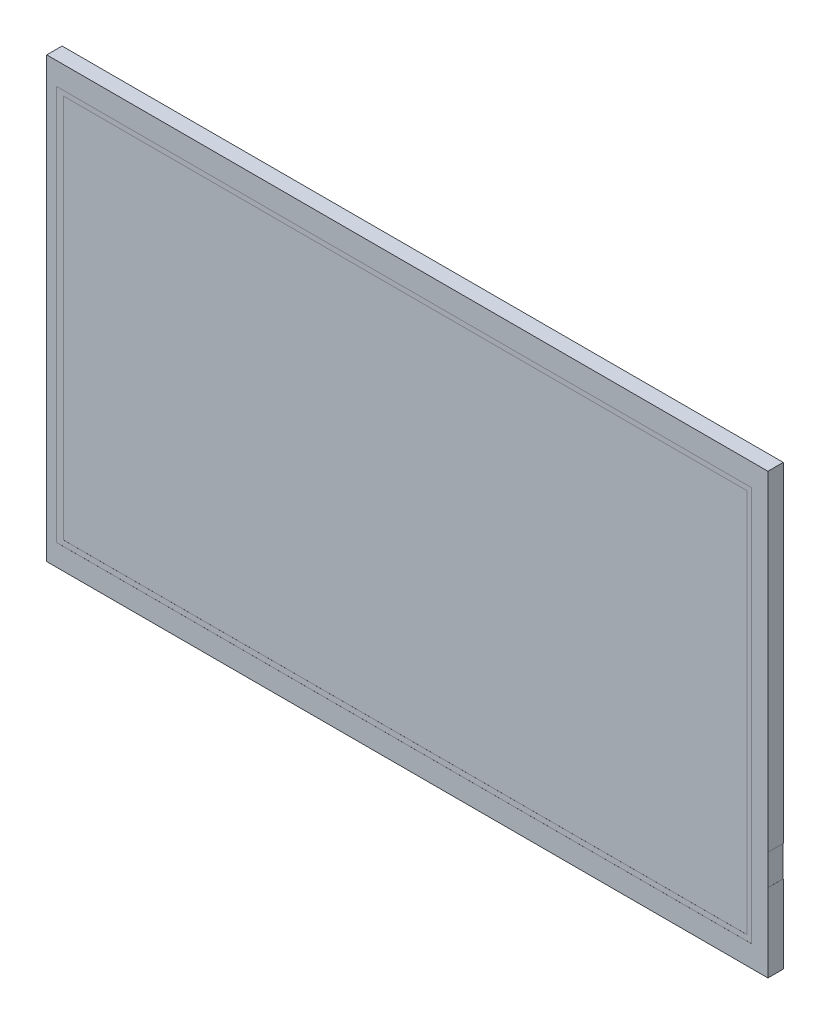
ISO-10303-21;
HEADER;
FILE_DESCRIPTION(('STEP AP214'),'2;1');
FILE_NAME('part.step','',(''),(''),'','','');
FILE_SCHEMA(('AUTOMOTIVE_DESIGN { 1 0 10303 214 1 1 1 1 }'));
ENDSEC;
DATA;
#1=APPLICATION_CONTEXT('core data for automotive mechanical design processes');
#2=APPLICATION_PROTOCOL_DEFINITION('international standard','automotive_design',2000,#1);
#3=PRODUCT_CONTEXT('',#1,'mechanical');
#4=PRODUCT('Part','Part','',(#3));
#5=PRODUCT_RELATED_PRODUCT_CATEGORY('part','',(#4));
#6=PRODUCT_DEFINITION_FORMATION('','',#4);
#7=PRODUCT_DEFINITION_CONTEXT('part definition',#1,'design');
#8=PRODUCT_DEFINITION('design','',#6,#7);
#9=PRODUCT_DEFINITION_SHAPE('','',#8);
#10=(LENGTH_UNIT() NAMED_UNIT(*) SI_UNIT(.MILLI.,.METRE.));
#11=(NAMED_UNIT(*) PLANE_ANGLE_UNIT() SI_UNIT($,.RADIAN.));
#12=(NAMED_UNIT(*) SI_UNIT($,.STERADIAN.) SOLID_ANGLE_UNIT());
#13=UNCERTAINTY_MEASURE_WITH_UNIT(LENGTH_MEASURE(1.E-05),#10,'distance_accuracy_value','');
#14=(GEOMETRIC_REPRESENTATION_CONTEXT(3) GLOBAL_UNCERTAINTY_ASSIGNED_CONTEXT((#13)) GLOBAL_UNIT_ASSIGNED_CONTEXT((#10,
#11,#12)) REPRESENTATION_CONTEXT('',''));
#15=CARTESIAN_POINT('',(0.,0.,0.));
#16=DIRECTION('',(0.,0.,1.));
#17=DIRECTION('',(1.,0.,0.));
#18=AXIS2_PLACEMENT_3D('',#15,#16,#17);
#19=CARTESIAN_POINT('',(117.5,-71.5000000000001,4.99999999999012));
#20=DIRECTION('',(-1.,0.,0.));
#21=DIRECTION('',(0.,0.,1.00000000000004));
#22=AXIS2_PLACEMENT_3D('',#19,#20,#21);
#23=PLANE('',#22);
#24=DIRECTION('',(0.,1.00000000000004,0.));
#25=VECTOR('',#24,1.);
#26=CARTESIAN_POINT('',(117.5,-71.5000000000001,4.99999999999012));
#27=LINE('',#26,#25);
#28=CARTESIAN_POINT('',(117.5,-35.9999999999987,4.99999999999368));
#29=VERTEX_POINT('',#28);
#30=CARTESIAN_POINT('',(117.5,71.5000000000008,4.99999999999545));
#31=VERTEX_POINT('',#30);
#32=EDGE_CURVE('E296',#29,#31,#27,.T.);
#33=ORIENTED_EDGE('',*,*,#32,.F.);
#34=DIRECTION('',(0.,0.,1.00000000000004));
#35=VECTOR('',#34,1.);
#36=CARTESIAN_POINT('',(117.5,-35.9999999999987,4.99999999999368));
#37=LINE('',#36,#35);
#38=CARTESIAN_POINT('',(117.500000000001,-36.0000000000049,2.66453525910038E-12));
#39=VERTEX_POINT('',#38);
#40=EDGE_CURVE('E205',#39,#29,#37,.T.);
#41=ORIENTED_EDGE('',*,*,#40,.F.);
#42=DIRECTION('',(0.,1.00000000000004,0.));
#43=VECTOR('',#42,1.);
#44=CARTESIAN_POINT('',(117.5,-71.5000000000017,0.));
#45=LINE('',#44,#43);
#46=CARTESIAN_POINT('',(117.5,71.499999999999,1.77635683940025E-12));
#47=VERTEX_POINT('',#46);
#48=EDGE_CURVE('E308',#39,#47,#45,.T.);
#49=ORIENTED_EDGE('',*,*,#48,.T.);
#50=DIRECTION('',(0.,0.,-1.00000000000004));
#51=VECTOR('',#50,1.);
#52=CARTESIAN_POINT('',(117.5,71.5000000000008,4.99999999999545));
#53=LINE('',#52,#51);
#54=EDGE_CURVE('E315',#31,#47,#53,.T.);
#55=ORIENTED_EDGE('',*,*,#54,.F.);
#56=EDGE_LOOP('',(#33,#41,#49,#55));
#57=FACE_BOUND('',#56,.T.);
#58=ADVANCED_FACE('F38',(#57),#23,.F.);
#59=CARTESIAN_POINT('',(-117.500000000001,-71.5000000000014,4.99999999999012));
#60=DIRECTION('',(1.,0.,0.));
#61=DIRECTION('',(0.,0.,-1.00000000000004));
#62=AXIS2_PLACEMENT_3D('',#59,#60,#61);
#63=PLANE('',#62);
#64=DIRECTION('',(0.,-1.00000000000004,0.));
#65=VECTOR('',#64,1.);
#66=CARTESIAN_POINT('',(-117.500000000001,-71.5000000000021,0.));
#67=LINE('',#66,#65);
#68=CARTESIAN_POINT('',(-117.5,71.499999999999,1.77635683940025E-12));
#69=VERTEX_POINT('',#68);
#70=CARTESIAN_POINT('',(-117.500000000001,-71.5000000000021,0.));
#71=VERTEX_POINT('',#70);
#72=EDGE_CURVE('E283',#69,#71,#67,.T.);
#73=ORIENTED_EDGE('',*,*,#72,.T.);
#74=DIRECTION('',(0.,0.,-1.00000000000004));
#75=VECTOR('',#74,1.);
#76=CARTESIAN_POINT('',(-117.500000000001,-71.5000000000014,4.99999999999012));
#77=LINE('',#76,#75);
#78=CARTESIAN_POINT('',(-117.500000000001,-71.5000000000014,4.99999999999012));
#79=VERTEX_POINT('',#78);
#80=EDGE_CURVE('E11',#79,#71,#77,.T.);
#81=ORIENTED_EDGE('',*,*,#80,.F.);
#82=DIRECTION('',(0.,-1.00000000000004,0.));
#83=VECTOR('',#82,1.);
#84=CARTESIAN_POINT('',(-117.500000000001,-71.5000000000014,4.99999999999012));
#85=LINE('',#84,#83);
#86=CARTESIAN_POINT('',(-117.5,71.4999999999977,4.99999999999901));
#87=VERTEX_POINT('',#86);
#88=EDGE_CURVE('E290',#87,#79,#85,.T.);
#89=ORIENTED_EDGE('',*,*,#88,.F.);
#90=DIRECTION('',(0.,0.,-1.00000000000004));
#91=VECTOR('',#90,1.);
#92=CARTESIAN_POINT('',(-117.5,71.4999999999977,4.99999999999901));
#93=LINE('',#92,#91);
#94=EDGE_CURVE('E302',#87,#69,#93,.T.);
#95=ORIENTED_EDGE('',*,*,#94,.T.);
#96=EDGE_LOOP('',(#73,#81,#89,#95));
#97=FACE_BOUND('',#96,.T.);
#98=ADVANCED_FACE('F40',(#97),#63,.F.);
#99=CARTESIAN_POINT('',(117.5,-71.5000000000001,4.99999999999012));
#100=DIRECTION('',(0.,1.00000000000004,0.));
#101=DIRECTION('',(-1.,0.,0.));
#102=AXIS2_PLACEMENT_3D('',#99,#100,#101);
#103=PLANE('',#102);
#104=DIRECTION('',(1.,0.,0.));
#105=VECTOR('',#104,1.);
#106=CARTESIAN_POINT('',(117.5,-71.5000000000017,0.));
#107=LINE('',#106,#105);
#108=CARTESIAN_POINT('',(-13.3200000000006,-71.5000000000012,0.));
#109=VERTEX_POINT('',#108);
#110=EDGE_CURVE('E305',#71,#109,#107,.T.);
#111=ORIENTED_EDGE('',*,*,#110,.T.);
#112=DIRECTION('',(0.,0.,-1.00000000000004));
#113=VECTOR('',#112,1.);
#114=CARTESIAN_POINT('',(-13.3200000000006,-71.5000000000012,0.));
#115=LINE('',#114,#113);
#116=CARTESIAN_POINT('',(-13.3200000000005,-71.500000000001,1.99999999999978));
#117=VERTEX_POINT('',#116);
#118=EDGE_CURVE('E344',#117,#109,#115,.T.);
#119=ORIENTED_EDGE('',*,*,#118,.F.);
#120=DIRECTION('',(-1.,0.,0.));
#121=VECTOR('',#120,1.);
#122=CARTESIAN_POINT('',(-13.3200000000005,-71.500000000001,1.99999999999978));
#123=LINE('',#122,#121);
#124=CARTESIAN_POINT('',(24.9799999999981,-71.500000000001,1.99999999999978));
#125=VERTEX_POINT('',#124);
#126=EDGE_CURVE('E349',#125,#117,#123,.T.);
#127=ORIENTED_EDGE('',*,*,#126,.F.);
#128=DIRECTION('',(0.,0.,1.00000000000004));
#129=VECTOR('',#128,1.);
#130=CARTESIAN_POINT('',(24.979999999998,-71.5000000000012,0.));
#131=LINE('',#130,#129);
#132=CARTESIAN_POINT('',(24.979999999998,-71.5000000000012,0.));
#133=VERTEX_POINT('',#132);
#134=EDGE_CURVE('E347',#133,#125,#131,.T.);
#135=ORIENTED_EDGE('',*,*,#134,.F.);
#136=CARTESIAN_POINT('',(117.5,-71.5000000000017,0.));
#137=VERTEX_POINT('',#136);
#138=EDGE_CURVE('E195',#133,#137,#107,.T.);
#139=ORIENTED_EDGE('',*,*,#138,.T.);
#140=DIRECTION('',(0.,0.,-1.00000000000004));
#141=VECTOR('',#140,1.);
#142=CARTESIAN_POINT('',(117.5,-71.5000000000001,4.99999999999012));
#143=LINE('',#142,#141);
#144=CARTESIAN_POINT('',(117.5,-71.5000000000001,4.99999999999012));
#145=VERTEX_POINT('',#144);
#146=EDGE_CURVE('E46',#145,#137,#143,.T.);
#147=ORIENTED_EDGE('',*,*,#146,.F.);
#148=DIRECTION('',(1.,0.,0.));
#149=VECTOR('',#148,1.);
#150=CARTESIAN_POINT('',(117.5,-71.5000000000001,4.99999999999012));
#151=LINE('',#150,#149);
#152=EDGE_CURVE('E293',#79,#145,#151,.T.);
#153=ORIENTED_EDGE('',*,*,#152,.F.);
#154=ORIENTED_EDGE('',*,*,#80,.T.);
#155=EDGE_LOOP('',(#111,#119,#127,#135,#139,#147,#153,#154));
#156=FACE_BOUND('',#155,.T.);
#157=ADVANCED_FACE('F335',(#156),#103,.F.);
#158=CARTESIAN_POINT('',(117.5,-46.0000000000012,1.77635683940025E-12));
#159=VERTEX_POINT('',#158);
#160=EDGE_CURVE('E309',#137,#159,#45,.T.);
#161=ORIENTED_EDGE('',*,*,#160,.T.);
#162=DIRECTION('',(0.,0.,-1.00000000000004));
#163=VECTOR('',#162,1.);
#164=CARTESIAN_POINT('',(117.5,-45.9999999999996,4.99999999999901));
#165=LINE('',#164,#163);
#166=CARTESIAN_POINT('',(117.5,-45.9999999999996,4.99999999999901));
#167=VERTEX_POINT('',#166);
#168=EDGE_CURVE('E213',#167,#159,#165,.T.);
#169=ORIENTED_EDGE('',*,*,#168,.F.);
#170=EDGE_CURVE('E297',#145,#167,#27,.T.);
#171=ORIENTED_EDGE('',*,*,#170,.F.);
#172=ORIENTED_EDGE('',*,*,#146,.T.);
#173=EDGE_LOOP('',(#161,#169,#171,#172));
#174=FACE_BOUND('',#173,.T.);
#175=ADVANCED_FACE('F321',(#174),#23,.F.);
#176=CARTESIAN_POINT('',(117.5,71.5000000000008,4.99999999999545));
#177=DIRECTION('',(0.,-1.00000000000004,0.));
#178=DIRECTION('',(1.,0.,0.));
#179=AXIS2_PLACEMENT_3D('',#176,#177,#178);
#180=PLANE('',#179);
#181=DIRECTION('',(-1.,0.,0.));
#182=VECTOR('',#181,1.);
#183=CARTESIAN_POINT('',(117.5,71.499999999999,1.77635683940025E-12));
#184=LINE('',#183,#182);
#185=EDGE_CURVE('E294',#47,#69,#184,.T.);
#186=ORIENTED_EDGE('',*,*,#185,.T.);
#187=ORIENTED_EDGE('',*,*,#94,.F.);
#188=DIRECTION('',(-1.,0.,0.));
#189=VECTOR('',#188,1.);
#190=CARTESIAN_POINT('',(117.5,71.5000000000008,4.99999999999545));
#191=LINE('',#190,#189);
#192=EDGE_CURVE('E300',#31,#87,#191,.T.);
#193=ORIENTED_EDGE('',*,*,#192,.F.);
#194=ORIENTED_EDGE('',*,*,#54,.T.);
#195=EDGE_LOOP('',(#186,#187,#193,#194));
#196=FACE_BOUND('',#195,.T.);
#197=ADVANCED_FACE('F375',(#196),#180,.F.);
#198=CARTESIAN_POINT('',(0.,-2.66453525910038E-12,5.00000000000256));
#199=DIRECTION('',(0.,0.,1.00000000000004));
#200=DIRECTION('',(1.,0.,0.));
#201=AXIS2_PLACEMENT_3D('',#198,#199,#200);
#202=PLANE('',#201);
#203=DIRECTION('',(1.,0.,0.));
#204=VECTOR('',#203,1.);
#205=CARTESIAN_POINT('',(117.49,-35.9999999999987,4.99999999999368));
#206=LINE('',#205,#204);
#207=CARTESIAN_POINT('',(117.49,-35.9999999999987,4.99999999999368));
#208=VERTEX_POINT('',#207);
#209=EDGE_CURVE('E216',#208,#29,#206,.T.);
#210=ORIENTED_EDGE('',*,*,#209,.T.);
#211=ORIENTED_EDGE('',*,*,#32,.T.);
#212=ORIENTED_EDGE('',*,*,#192,.T.);
#213=ORIENTED_EDGE('',*,*,#88,.T.);
#214=ORIENTED_EDGE('',*,*,#152,.T.);
#215=ORIENTED_EDGE('',*,*,#170,.T.);
#216=DIRECTION('',(1.,0.,0.));
#217=VECTOR('',#216,1.);
#218=CARTESIAN_POINT('',(117.49,-45.9999999999996,4.99999999999901));
#219=LINE('',#218,#217);
#220=CARTESIAN_POINT('',(117.49,-45.9999999999996,4.99999999999901));
#221=VERTEX_POINT('',#220);
#222=EDGE_CURVE('E212',#221,#167,#219,.T.);
#223=ORIENTED_EDGE('',*,*,#222,.F.);
#224=DIRECTION('',(0.,-1.00000000000004,0.));
#225=VECTOR('',#224,1.);
#226=CARTESIAN_POINT('',(117.49,-35.9999999999987,4.99999999999368));
#227=LINE('',#226,#225);
#228=EDGE_CURVE('E203',#208,#221,#227,.T.);
#229=ORIENTED_EDGE('',*,*,#228,.F.);
#230=EDGE_LOOP('',(#210,#211,#212,#213,#214,#215,#223,#229));
#231=FACE_BOUND('',#230,.T.);
#232=DIRECTION('',(0.,1.00000000000004,0.));
#233=VECTOR('',#232,1.);
#234=CARTESIAN_POINT('',(112.15,64.1999999999996,4.99999999999989));
#235=LINE('',#234,#233);
#236=CARTESIAN_POINT('',(112.149999999998,-64.5000000000016,5.00000000000078));
#237=VERTEX_POINT('',#236);
#238=CARTESIAN_POINT('',(112.15,64.1999999999996,4.99999999999989));
#239=VERTEX_POINT('',#238);
#240=EDGE_CURVE('E251',#237,#239,#235,.T.);
#241=ORIENTED_EDGE('',*,*,#240,.F.);
#242=DIRECTION('',(1.,0.,0.));
#243=VECTOR('',#242,1.);
#244=CARTESIAN_POINT('',(-114.250000000001,-64.5000000000016,5.00000000000078));
#245=LINE('',#244,#243);
#246=CARTESIAN_POINT('',(-114.250000000001,-64.5000000000016,5.00000000000078));
#247=VERTEX_POINT('',#246);
#248=EDGE_CURVE('E262',#247,#237,#245,.T.);
#249=ORIENTED_EDGE('',*,*,#248,.F.);
#250=DIRECTION('',(0.,-1.00000000000004,0.));
#251=VECTOR('',#250,1.);
#252=CARTESIAN_POINT('',(-114.25,64.1999999999996,4.99999999999989));
#253=LINE('',#252,#251);
#254=CARTESIAN_POINT('',(-114.25,64.1999999999996,4.99999999999989));
#255=VERTEX_POINT('',#254);
#256=EDGE_CURVE('E276',#255,#247,#253,.T.);
#257=ORIENTED_EDGE('',*,*,#256,.F.);
#258=DIRECTION('',(-1.,0.,0.));
#259=VECTOR('',#258,1.);
#260=CARTESIAN_POINT('',(-114.25,64.1999999999996,4.99999999999989));
#261=LINE('',#260,#259);
#262=EDGE_CURVE('E273',#239,#255,#261,.T.);
#263=ORIENTED_EDGE('',*,*,#262,.F.);
#264=EDGE_LOOP('',(#241,#249,#257,#263));
#265=FACE_BOUND('',#264,.T.);
#266=ADVANCED_FACE('F330',(#231,#265),#202,.T.);
#267=CARTESIAN_POINT('',(0.,0.,0.));
#268=DIRECTION('',(0.,0.,1.00000000000004));
#269=DIRECTION('',(1.,0.,0.));
#270=AXIS2_PLACEMENT_3D('',#267,#268,#269);
#271=PLANE('',#270);
#272=DIRECTION('',(1.,0.,0.));
#273=VECTOR('',#272,1.);
#274=CARTESIAN_POINT('',(-13.3200000000006,-71.4900000000014,0.));
#275=LINE('',#274,#273);
#276=CARTESIAN_POINT('',(-13.3200000000006,-71.4900000000014,0.));
#277=VERTEX_POINT('',#276);
#278=CARTESIAN_POINT('',(24.9799999999979,-71.4900000000014,0.));
#279=VERTEX_POINT('',#278);
#280=EDGE_CURVE('E185',#277,#279,#275,.T.);
#281=ORIENTED_EDGE('',*,*,#280,.F.);
#282=DIRECTION('',(0.,-1.00000000000004,0.));
#283=VECTOR('',#282,1.);
#284=CARTESIAN_POINT('',(-13.3200000000006,-71.4900000000014,0.));
#285=LINE('',#284,#283);
#286=EDGE_CURVE('E196',#277,#109,#285,.T.);
#287=ORIENTED_EDGE('',*,*,#286,.T.);
#288=ORIENTED_EDGE('',*,*,#110,.F.);
#289=ORIENTED_EDGE('',*,*,#72,.F.);
#290=ORIENTED_EDGE('',*,*,#185,.F.);
#291=ORIENTED_EDGE('',*,*,#48,.F.);
#292=DIRECTION('',(1.,0.,0.));
#293=VECTOR('',#292,1.);
#294=CARTESIAN_POINT('',(117.490000000001,-36.0000000000049,2.66453525910038E-12));
#295=LINE('',#294,#293);
#296=CARTESIAN_POINT('',(117.490000000001,-36.0000000000049,2.66453525910038E-12));
#297=VERTEX_POINT('',#296);
#298=EDGE_CURVE('E220',#297,#39,#295,.T.);
#299=ORIENTED_EDGE('',*,*,#298,.F.);
#300=DIRECTION('',(0.,1.00000000000004,0.));
#301=VECTOR('',#300,1.);
#302=CARTESIAN_POINT('',(117.490000000001,-36.0000000000049,2.66453525910038E-12));
#303=LINE('',#302,#301);
#304=CARTESIAN_POINT('',(117.490000000001,-46.0000000000012,1.77635683940025E-12));
#305=VERTEX_POINT('',#304);
#306=EDGE_CURVE('E207',#305,#297,#303,.T.);
#307=ORIENTED_EDGE('',*,*,#306,.F.);
#308=DIRECTION('',(1.,0.,0.));
#309=VECTOR('',#308,1.);
#310=CARTESIAN_POINT('',(117.490000000001,-46.0000000000012,1.77635683940025E-12));
#311=LINE('',#310,#309);
#312=EDGE_CURVE('E222',#305,#159,#311,.T.);
#313=ORIENTED_EDGE('',*,*,#312,.T.);
#314=ORIENTED_EDGE('',*,*,#160,.F.);
#315=ORIENTED_EDGE('',*,*,#138,.F.);
#316=DIRECTION('',(0.,-1.00000000000004,0.));
#317=VECTOR('',#316,1.);
#318=CARTESIAN_POINT('',(24.9799999999979,-71.4900000000014,0.));
#319=LINE('',#318,#317);
#320=EDGE_CURVE('E180',#279,#133,#319,.T.);
#321=ORIENTED_EDGE('',*,*,#320,.F.);
#322=EDGE_LOOP('',(#281,#287,#288,#289,#290,#291,#299,#307,#313,#314,#315,#321));
#323=FACE_BOUND('',#322,.T.);
#324=ADVANCED_FACE('F193',(#323),#271,.F.);
#325=CARTESIAN_POINT('',(112.15,64.2,4.99000000000027));
#326=DIRECTION('',(1.,0.,0.));
#327=DIRECTION('',(0.,1.00000000000004,0.));
#328=AXIS2_PLACEMENT_3D('',#325,#326,#327);
#329=PLANE('',#328);
#330=ORIENTED_EDGE('',*,*,#240,.T.);
#331=DIRECTION('',(0.,0.,1.00000000000004));
#332=VECTOR('',#331,1.);
#333=CARTESIAN_POINT('',(112.15,64.2,4.99000000000027));
#334=LINE('',#333,#332);
#335=CARTESIAN_POINT('',(112.15,64.2,4.99000000000027));
#336=VERTEX_POINT('',#335);
#337=EDGE_CURVE('E271',#336,#239,#334,.T.);
#338=ORIENTED_EDGE('',*,*,#337,.F.);
#339=DIRECTION('',(0.,1.00000000000004,0.));
#340=VECTOR('',#339,1.);
#341=CARTESIAN_POINT('',(112.15,64.2,4.99000000000027));
#342=LINE('',#341,#340);
#343=CARTESIAN_POINT('',(112.149999999998,-64.5000000000002,4.98999999999938));
#344=VERTEX_POINT('',#343);
#345=EDGE_CURVE('E258',#344,#336,#342,.T.);
#346=ORIENTED_EDGE('',*,*,#345,.F.);
#347=DIRECTION('',(0.,0.,1.00000000000004));
#348=VECTOR('',#347,1.);
#349=CARTESIAN_POINT('',(112.149999999998,-64.5000000000002,4.98999999999938));
#350=LINE('',#349,#348);
#351=EDGE_CURVE('E281',#344,#237,#350,.T.);
#352=ORIENTED_EDGE('',*,*,#351,.T.);
#353=EDGE_LOOP('',(#330,#338,#346,#352));
#354=FACE_BOUND('',#353,.T.);
#355=ADVANCED_FACE('F516',(#354),#329,.F.);
#356=CARTESIAN_POINT('',(-114.250000000001,-64.5000000000033,4.98999999999938));
#357=DIRECTION('',(0.,-1.00000000000004,0.));
#358=DIRECTION('',(0.,0.,-1.00000000000004));
#359=AXIS2_PLACEMENT_3D('',#356,#357,#358);
#360=PLANE('',#359);
#361=ORIENTED_EDGE('',*,*,#248,.T.);
#362=ORIENTED_EDGE('',*,*,#351,.F.);
#363=DIRECTION('',(1.,0.,0.));
#364=VECTOR('',#363,1.);
#365=CARTESIAN_POINT('',(-114.250000000001,-64.5000000000033,4.98999999999938));
#366=LINE('',#365,#364);
#367=CARTESIAN_POINT('',(-114.250000000001,-64.5000000000033,4.98999999999938));
#368=VERTEX_POINT('',#367);
#369=EDGE_CURVE('E268',#368,#344,#366,.T.);
#370=ORIENTED_EDGE('',*,*,#369,.F.);
#371=DIRECTION('',(0.,0.,1.00000000000004));
#372=VECTOR('',#371,1.);
#373=CARTESIAN_POINT('',(-114.250000000001,-64.5000000000033,4.98999999999938));
#374=LINE('',#373,#372);
#375=EDGE_CURVE('E284',#368,#247,#374,.T.);
#376=ORIENTED_EDGE('',*,*,#375,.T.);
#377=EDGE_LOOP('',(#361,#362,#370,#376));
#378=FACE_BOUND('',#377,.T.);
#379=ADVANCED_FACE('F508',(#378),#360,.F.);
#380=CARTESIAN_POINT('',(-114.25,64.199999999992,4.9899999999985));
#381=DIRECTION('',(-1.,0.,0.));
#382=DIRECTION('',(0.,0.,1.00000000000004));
#383=AXIS2_PLACEMENT_3D('',#380,#381,#382);
#384=PLANE('',#383);
#385=ORIENTED_EDGE('',*,*,#256,.T.);
#386=ORIENTED_EDGE('',*,*,#375,.F.);
#387=DIRECTION('',(0.,-1.00000000000004,0.));
#388=VECTOR('',#387,1.);
#389=CARTESIAN_POINT('',(-114.25,64.199999999992,4.9899999999985));
#390=LINE('',#389,#388);
#391=CARTESIAN_POINT('',(-114.25,64.199999999992,4.9899999999985));
#392=VERTEX_POINT('',#391);
#393=EDGE_CURVE('E265',#392,#368,#390,.T.);
#394=ORIENTED_EDGE('',*,*,#393,.F.);
#395=DIRECTION('',(0.,0.,1.00000000000004));
#396=VECTOR('',#395,1.);
#397=CARTESIAN_POINT('',(-114.25,64.199999999992,4.9899999999985));
#398=LINE('',#397,#396);
#399=EDGE_CURVE('E286',#392,#255,#398,.T.);
#400=ORIENTED_EDGE('',*,*,#399,.T.);
#401=EDGE_LOOP('',(#385,#386,#394,#400));
#402=FACE_BOUND('',#401,.T.);
#403=ADVANCED_FACE('F500',(#402),#384,.F.);
#404=CARTESIAN_POINT('',(-114.25,64.199999999992,4.9899999999985));
#405=DIRECTION('',(0.,1.00000000000004,0.));
#406=DIRECTION('',(0.,0.,1.00000000000004));
#407=AXIS2_PLACEMENT_3D('',#404,#405,#406);
#408=PLANE('',#407);
#409=ORIENTED_EDGE('',*,*,#262,.T.);
#410=ORIENTED_EDGE('',*,*,#399,.F.);
#411=DIRECTION('',(-1.,0.,0.));
#412=VECTOR('',#411,1.);
#413=CARTESIAN_POINT('',(-114.25,64.199999999992,4.9899999999985));
#414=LINE('',#413,#412);
#415=EDGE_CURVE('E261',#336,#392,#414,.T.);
#416=ORIENTED_EDGE('',*,*,#415,.F.);
#417=ORIENTED_EDGE('',*,*,#337,.T.);
#418=EDGE_LOOP('',(#409,#410,#416,#417));
#419=FACE_BOUND('',#418,.T.);
#420=ADVANCED_FACE('F492',(#419),#408,.F.);
#421=CARTESIAN_POINT('',(0.,4.44089209850063E-13,4.98999999999938));
#422=DIRECTION('',(0.,0.,1.00000000000004));
#423=DIRECTION('',(1.,0.,0.));
#424=AXIS2_PLACEMENT_3D('',#421,#422,#423);
#425=PLANE('',#424);
#426=DIRECTION('',(0.,-1.00000000000004,0.));
#427=VECTOR('',#426,1.);
#428=CARTESIAN_POINT('',(-112.,-62.689999999999,4.98999999999583));
#429=LINE('',#428,#427);
#430=CARTESIAN_POINT('',(-112.,62.5899999999904,4.98999999999405));
#431=VERTEX_POINT('',#430);
#432=CARTESIAN_POINT('',(-112.,-62.689999999999,4.98999999999583));
#433=VERTEX_POINT('',#432);
#434=EDGE_CURVE('E219',#431,#433,#429,.T.);
#435=ORIENTED_EDGE('',*,*,#434,.F.);
#436=DIRECTION('',(-1.,0.,0.));
#437=VECTOR('',#436,1.);
#438=CARTESIAN_POINT('',(110.72,62.5899999999966,4.98999999999494));
#439=LINE('',#438,#437);
#440=CARTESIAN_POINT('',(110.72,62.5899999999966,4.98999999999494));
#441=VERTEX_POINT('',#440);
#442=EDGE_CURVE('E230',#441,#431,#439,.T.);
#443=ORIENTED_EDGE('',*,*,#442,.F.);
#444=DIRECTION('',(0.,1.00000000000004,0.));
#445=VECTOR('',#444,1.);
#446=CARTESIAN_POINT('',(110.719999999998,-62.6899999999986,4.98999999999583));
#447=LINE('',#446,#445);
#448=CARTESIAN_POINT('',(110.719999999998,-62.6899999999986,4.98999999999583));
#449=VERTEX_POINT('',#448);
#450=EDGE_CURVE('E244',#449,#441,#447,.T.);
#451=ORIENTED_EDGE('',*,*,#450,.F.);
#452=DIRECTION('',(1.,0.,0.));
#453=VECTOR('',#452,1.);
#454=CARTESIAN_POINT('',(110.719999999998,-62.6899999999986,4.98999999999583));
#455=LINE('',#454,#453);
#456=EDGE_CURVE('E241',#433,#449,#455,.T.);
#457=ORIENTED_EDGE('',*,*,#456,.F.);
#458=EDGE_LOOP('',(#435,#443,#451,#457));
#459=FACE_BOUND('',#458,.T.);
#460=ORIENTED_EDGE('',*,*,#345,.T.);
#461=ORIENTED_EDGE('',*,*,#415,.T.);
#462=ORIENTED_EDGE('',*,*,#393,.T.);
#463=ORIENTED_EDGE('',*,*,#369,.T.);
#464=EDGE_LOOP('',(#460,#461,#462,#463));
#465=FACE_BOUND('',#464,.T.);
#466=ADVANCED_FACE('F484',(#459,#465),#425,.T.);
#467=CARTESIAN_POINT('',(-112.,-62.6900000000115,4.97999999999355));
#468=DIRECTION('',(-1.,0.,0.));
#469=DIRECTION('',(0.,-1.00000000000004,0.));
#470=AXIS2_PLACEMENT_3D('',#467,#468,#469);
#471=PLANE('',#470);
#472=ORIENTED_EDGE('',*,*,#434,.T.);
#473=DIRECTION('',(0.,0.,1.00000000000004));
#474=VECTOR('',#473,1.);
#475=CARTESIAN_POINT('',(-112.,-62.6900000000115,4.97999999999355));
#476=LINE('',#475,#474);
#477=CARTESIAN_POINT('',(-112.,-62.6900000000115,4.97999999999355));
#478=VERTEX_POINT('',#477);
#479=EDGE_CURVE('E239',#478,#433,#476,.T.);
#480=ORIENTED_EDGE('',*,*,#479,.F.);
#481=DIRECTION('',(0.,-1.00000000000004,0.));
#482=VECTOR('',#481,1.);
#483=CARTESIAN_POINT('',(-112.,-62.6900000000115,4.97999999999355));
#484=LINE('',#483,#482);
#485=CARTESIAN_POINT('',(-112.,62.5899999999962,4.97999999999532));
#486=VERTEX_POINT('',#485);
#487=EDGE_CURVE('E226',#486,#478,#484,.T.);
#488=ORIENTED_EDGE('',*,*,#487,.F.);
#489=DIRECTION('',(0.,0.,1.00000000000004));
#490=VECTOR('',#489,1.);
#491=CARTESIAN_POINT('',(-112.,62.5899999999962,4.97999999999532));
#492=LINE('',#491,#490);
#493=EDGE_CURVE('E249',#486,#431,#492,.T.);
#494=ORIENTED_EDGE('',*,*,#493,.T.);
#495=EDGE_LOOP('',(#472,#480,#488,#494));
#496=FACE_BOUND('',#495,.T.);
#497=ADVANCED_FACE('F476',(#496),#471,.F.);
#498=CARTESIAN_POINT('',(110.72,62.5899999999997,4.97999999999621));
#499=DIRECTION('',(0.,1.00000000000004,0.));
#500=DIRECTION('',(-1.,0.,0.));
#501=AXIS2_PLACEMENT_3D('',#498,#499,#500);
#502=PLANE('',#501);
#503=ORIENTED_EDGE('',*,*,#442,.T.);
#504=ORIENTED_EDGE('',*,*,#493,.F.);
#505=DIRECTION('',(-1.,0.,0.));
#506=VECTOR('',#505,1.);
#507=CARTESIAN_POINT('',(110.72,62.5899999999997,4.97999999999621));
#508=LINE('',#507,#506);
#509=CARTESIAN_POINT('',(110.72,62.5899999999997,4.97999999999621));
#510=VERTEX_POINT('',#509);
#511=EDGE_CURVE('E236',#510,#486,#508,.T.);
#512=ORIENTED_EDGE('',*,*,#511,.F.);
#513=DIRECTION('',(0.,0.,1.00000000000004));
#514=VECTOR('',#513,1.);
#515=CARTESIAN_POINT('',(110.72,62.5899999999997,4.97999999999621));
#516=LINE('',#515,#514);
#517=EDGE_CURVE('E252',#510,#441,#516,.T.);
#518=ORIENTED_EDGE('',*,*,#517,.T.);
#519=EDGE_LOOP('',(#503,#504,#512,#518));
#520=FACE_BOUND('',#519,.T.);
#521=ADVANCED_FACE('F468',(#520),#502,.F.);
#522=CARTESIAN_POINT('',(110.719999999998,-62.690000000005,4.97999999999443));
#523=DIRECTION('',(1.,0.,0.));
#524=DIRECTION('',(0.,0.,-1.00000000000004));
#525=AXIS2_PLACEMENT_3D('',#522,#523,#524);
#526=PLANE('',#525);
#527=ORIENTED_EDGE('',*,*,#450,.T.);
#528=ORIENTED_EDGE('',*,*,#517,.F.);
#529=DIRECTION('',(0.,1.00000000000004,0.));
#530=VECTOR('',#529,1.);
#531=CARTESIAN_POINT('',(110.719999999998,-62.690000000005,4.97999999999443));
#532=LINE('',#531,#530);
#533=CARTESIAN_POINT('',(110.719999999998,-62.690000000005,4.97999999999443));
#534=VERTEX_POINT('',#533);
#535=EDGE_CURVE('E233',#534,#510,#532,.T.);
#536=ORIENTED_EDGE('',*,*,#535,.F.);
#537=DIRECTION('',(0.,0.,1.00000000000004));
#538=VECTOR('',#537,1.);
#539=CARTESIAN_POINT('',(110.719999999998,-62.690000000005,4.97999999999443));
#540=LINE('',#539,#538);
#541=EDGE_CURVE('E254',#534,#449,#540,.T.);
#542=ORIENTED_EDGE('',*,*,#541,.T.);
#543=EDGE_LOOP('',(#527,#528,#536,#542));
#544=FACE_BOUND('',#543,.T.);
#545=ADVANCED_FACE('F461',(#544),#526,.F.);
#546=CARTESIAN_POINT('',(110.719999999998,-62.690000000005,4.97999999999443));
#547=DIRECTION('',(0.,-1.00000000000004,0.));
#548=DIRECTION('',(0.,0.,-1.00000000000004));
#549=AXIS2_PLACEMENT_3D('',#546,#547,#548);
#550=PLANE('',#549);
#551=ORIENTED_EDGE('',*,*,#456,.T.);
#552=ORIENTED_EDGE('',*,*,#541,.F.);
#553=DIRECTION('',(1.,0.,0.));
#554=VECTOR('',#553,1.);
#555=CARTESIAN_POINT('',(110.719999999998,-62.690000000005,4.97999999999443));
#556=LINE('',#555,#554);
#557=EDGE_CURVE('E229',#478,#534,#556,.T.);
#558=ORIENTED_EDGE('',*,*,#557,.F.);
#559=ORIENTED_EDGE('',*,*,#479,.T.);
#560=EDGE_LOOP('',(#551,#552,#558,#559));
#561=FACE_BOUND('',#560,.T.);
#562=ADVANCED_FACE('F454',(#561),#550,.F.);
#563=CARTESIAN_POINT('',(0.,4.44089209850063E-13,4.97999999999976));
#564=DIRECTION('',(0.,0.,1.00000000000004));
#565=DIRECTION('',(1.,0.,0.));
#566=AXIS2_PLACEMENT_3D('',#563,#564,#565);
#567=PLANE('',#566);
#568=ORIENTED_EDGE('',*,*,#487,.T.);
#569=ORIENTED_EDGE('',*,*,#557,.T.);
#570=ORIENTED_EDGE('',*,*,#535,.T.);
#571=ORIENTED_EDGE('',*,*,#511,.T.);
#572=EDGE_LOOP('',(#568,#569,#570,#571));
#573=FACE_BOUND('',#572,.T.);
#574=ADVANCED_FACE('F397',(#573),#567,.T.);
#575=CARTESIAN_POINT('',(117.49,-35.9999999999987,4.99999999999368));
#576=DIRECTION('',(0.,1.00000000000004,0.));
#577=DIRECTION('',(0.,0.,1.00000000000004));
#578=AXIS2_PLACEMENT_3D('',#575,#576,#577);
#579=PLANE('',#578);
#580=ORIENTED_EDGE('',*,*,#40,.T.);
#581=ORIENTED_EDGE('',*,*,#209,.F.);
#582=DIRECTION('',(0.,0.,1.00000000000004));
#583=VECTOR('',#582,1.);
#584=CARTESIAN_POINT('',(117.49,-35.9999999999987,4.99999999999368));
#585=LINE('',#584,#583);
#586=EDGE_CURVE('E209',#297,#208,#585,.T.);
#587=ORIENTED_EDGE('',*,*,#586,.F.);
#588=ORIENTED_EDGE('',*,*,#298,.T.);
#589=EDGE_LOOP('',(#580,#581,#587,#588));
#590=FACE_BOUND('',#589,.T.);
#591=ADVANCED_FACE('F402',(#590),#579,.F.);
#592=CARTESIAN_POINT('',(117.49,-45.9999999999996,4.99999999999901));
#593=DIRECTION('',(0.,-1.00000000000004,0.));
#594=DIRECTION('',(0.,0.,-1.00000000000004));
#595=AXIS2_PLACEMENT_3D('',#592,#593,#594);
#596=PLANE('',#595);
#597=ORIENTED_EDGE('',*,*,#168,.T.);
#598=ORIENTED_EDGE('',*,*,#312,.F.);
#599=DIRECTION('',(0.,0.,-1.00000000000004));
#600=VECTOR('',#599,1.);
#601=CARTESIAN_POINT('',(117.49,-45.9999999999996,4.99999999999901));
#602=LINE('',#601,#600);
#603=EDGE_CURVE('E61',#221,#305,#602,.T.);
#604=ORIENTED_EDGE('',*,*,#603,.F.);
#605=ORIENTED_EDGE('',*,*,#222,.T.);
#606=EDGE_LOOP('',(#597,#598,#604,#605));
#607=FACE_BOUND('',#606,.T.);
#608=ADVANCED_FACE('F327',(#607),#596,.F.);
#609=CARTESIAN_POINT('',(117.49,0.,0.));
#610=DIRECTION('',(1.,0.,0.));
#611=DIRECTION('',(0.,0.,-1.00000000000004));
#612=AXIS2_PLACEMENT_3D('',#609,#610,#611);
#613=PLANE('',#612);
#614=ORIENTED_EDGE('',*,*,#228,.T.);
#615=ORIENTED_EDGE('',*,*,#603,.T.);
#616=ORIENTED_EDGE('',*,*,#306,.T.);
#617=ORIENTED_EDGE('',*,*,#586,.T.);
#618=EDGE_LOOP('',(#614,#615,#616,#617));
#619=FACE_BOUND('',#618,.T.);
#620=ADVANCED_FACE('F363',(#619),#613,.T.);
#621=CARTESIAN_POINT('',(-13.3200000000006,-71.4900000000014,0.));
#622=DIRECTION('',(-1.,0.,0.));
#623=DIRECTION('',(0.,-1.00000000000004,0.));
#624=AXIS2_PLACEMENT_3D('',#621,#622,#623);
#625=PLANE('',#624);
#626=ORIENTED_EDGE('',*,*,#118,.T.);
#627=ORIENTED_EDGE('',*,*,#286,.F.);
#628=DIRECTION('',(0.,0.,-1.00000000000004));
#629=VECTOR('',#628,1.);
#630=CARTESIAN_POINT('',(-13.3200000000006,-71.4900000000014,0.));
#631=LINE('',#630,#629);
#632=CARTESIAN_POINT('',(-13.3200000000006,-71.49000000001,2.00000000000955));
#633=VERTEX_POINT('',#632);
#634=EDGE_CURVE('E53',#633,#277,#631,.T.);
#635=ORIENTED_EDGE('',*,*,#634,.F.);
#636=DIRECTION('',(0.,-1.00000000000004,0.));
#637=VECTOR('',#636,1.);
#638=CARTESIAN_POINT('',(-13.3200000000006,-71.49000000001,2.00000000000955));
#639=LINE('',#638,#637);
#640=EDGE_CURVE('E198',#633,#117,#639,.T.);
#641=ORIENTED_EDGE('',*,*,#640,.T.);
#642=EDGE_LOOP('',(#626,#627,#635,#641));
#643=FACE_BOUND('',#642,.T.);
#644=ADVANCED_FACE('F343',(#643),#625,.F.);
#645=CARTESIAN_POINT('',(-13.3200000000006,-71.49000000001,2.00000000000955));
#646=DIRECTION('',(0.,0.,1.00000000000004));
#647=DIRECTION('',(1.,0.,0.));
#648=AXIS2_PLACEMENT_3D('',#645,#646,#647);
#649=PLANE('',#648);
#650=ORIENTED_EDGE('',*,*,#126,.T.);
#651=ORIENTED_EDGE('',*,*,#640,.F.);
#652=DIRECTION('',(-1.,0.,0.));
#653=VECTOR('',#652,1.);
#654=CARTESIAN_POINT('',(-13.3200000000006,-71.49000000001,2.00000000000955));
#655=LINE('',#654,#653);
#656=CARTESIAN_POINT('',(24.9799999999981,-71.49000000001,2.00000000000955));
#657=VERTEX_POINT('',#656);
#658=EDGE_CURVE('E184',#657,#633,#655,.T.);
#659=ORIENTED_EDGE('',*,*,#658,.F.);
#660=DIRECTION('',(0.,-1.00000000000004,0.));
#661=VECTOR('',#660,1.);
#662=CARTESIAN_POINT('',(24.9799999999981,-71.49000000001,2.00000000000955));
#663=LINE('',#662,#661);
#664=EDGE_CURVE('E182',#657,#125,#663,.T.);
#665=ORIENTED_EDGE('',*,*,#664,.T.);
#666=EDGE_LOOP('',(#650,#651,#659,#665));
#667=FACE_BOUND('',#666,.T.);
#668=ADVANCED_FACE('F355',(#667),#649,.F.);
#669=CARTESIAN_POINT('',(24.9799999999979,-71.4900000000014,0.));
#670=DIRECTION('',(1.,0.,0.));
#671=DIRECTION('',(0.,1.00000000000004,0.));
#672=AXIS2_PLACEMENT_3D('',#669,#670,#671);
#673=PLANE('',#672);
#674=ORIENTED_EDGE('',*,*,#134,.T.);
#675=ORIENTED_EDGE('',*,*,#664,.F.);
#676=DIRECTION('',(0.,0.,1.00000000000004));
#677=VECTOR('',#676,1.);
#678=CARTESIAN_POINT('',(24.9799999999979,-71.4900000000014,0.));
#679=LINE('',#678,#677);
#680=EDGE_CURVE('E176',#279,#657,#679,.T.);
#681=ORIENTED_EDGE('',*,*,#680,.F.);
#682=ORIENTED_EDGE('',*,*,#320,.T.);
#683=EDGE_LOOP('',(#674,#675,#681,#682));
#684=FACE_BOUND('',#683,.T.);
#685=ADVANCED_FACE('F178',(#684),#673,.F.);
#686=CARTESIAN_POINT('',(-2.22044604925031E-13,-71.4900000000014,0.));
#687=DIRECTION('',(0.,1.00000000000004,0.));
#688=DIRECTION('',(0.,0.,1.00000000000004));
#689=AXIS2_PLACEMENT_3D('',#686,#687,#688);
#690=PLANE('',#689);
#691=ORIENTED_EDGE('',*,*,#634,.T.);
#692=ORIENTED_EDGE('',*,*,#280,.T.);
#693=ORIENTED_EDGE('',*,*,#680,.T.);
#694=ORIENTED_EDGE('',*,*,#658,.T.);
#695=EDGE_LOOP('',(#691,#692,#693,#694));
#696=FACE_BOUND('',#695,.T.);
#697=ADVANCED_FACE('F188',(#696),#690,.F.);
#698=CLOSED_SHELL('',(#58,#98,#157,#175,#197,#266,#324,#355,#379,#403,#420,#466,#497,#521,#545,
#562,#574,#591,#608,#620,#644,#668,#685,#697));
#699=MANIFOLD_SOLID_BREP('B2',#698);
#700=ADVANCED_BREP_SHAPE_REPRESENTATION('',(#18,#699),#14);
#701=SHAPE_DEFINITION_REPRESENTATION(#9,#700);
ENDSEC;
END-ISO-10303-21;
